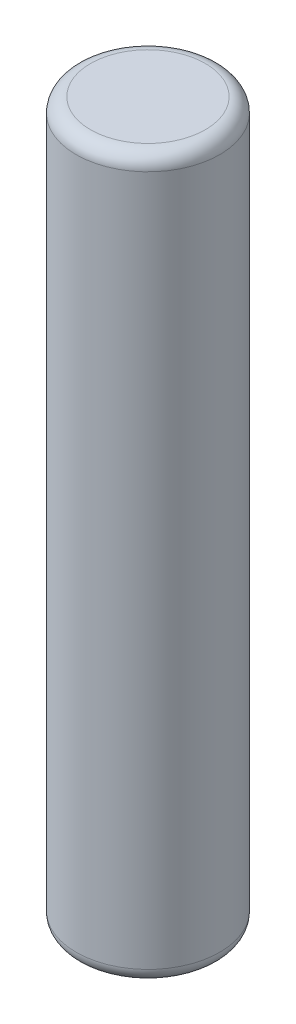
ISO-10303-21;
HEADER;
FILE_DESCRIPTION(('STEP AP214'),'2;1');
FILE_NAME('part.step','',(''),(''),'','','');
FILE_SCHEMA(('AUTOMOTIVE_DESIGN { 1 0 10303 214 1 1 1 1 }'));
ENDSEC;
DATA;
#1=APPLICATION_CONTEXT('core data for automotive mechanical design processes');
#2=APPLICATION_PROTOCOL_DEFINITION('international standard','automotive_design',2000,#1);
#3=PRODUCT_CONTEXT('',#1,'mechanical');
#4=PRODUCT('Part','Part','',(#3));
#5=PRODUCT_RELATED_PRODUCT_CATEGORY('part','',(#4));
#6=PRODUCT_DEFINITION_FORMATION('','',#4);
#7=PRODUCT_DEFINITION_CONTEXT('part definition',#1,'design');
#8=PRODUCT_DEFINITION('design','',#6,#7);
#9=PRODUCT_DEFINITION_SHAPE('','',#8);
#10=(LENGTH_UNIT() NAMED_UNIT(*) SI_UNIT(.MILLI.,.METRE.));
#11=(NAMED_UNIT(*) PLANE_ANGLE_UNIT() SI_UNIT($,.RADIAN.));
#12=(NAMED_UNIT(*) SI_UNIT($,.STERADIAN.) SOLID_ANGLE_UNIT());
#13=UNCERTAINTY_MEASURE_WITH_UNIT(LENGTH_MEASURE(1.E-05),#10,'distance_accuracy_value','');
#14=(GEOMETRIC_REPRESENTATION_CONTEXT(3) GLOBAL_UNCERTAINTY_ASSIGNED_CONTEXT((#13)) GLOBAL_UNIT_ASSIGNED_CONTEXT((#10,
#11,#12)) REPRESENTATION_CONTEXT('',''));
#15=CARTESIAN_POINT('',(0.,0.,0.));
#16=DIRECTION('',(0.,0.,1.));
#17=DIRECTION('',(1.,0.,0.));
#18=AXIS2_PLACEMENT_3D('',#15,#16,#17);
#19=CARTESIAN_POINT('',(0.,50.,0.));
#20=DIRECTION('',(0.,-1.,0.));
#21=DIRECTION('',(0.,0.,-1.));
#22=AXIS2_PLACEMENT_3D('',#19,#20,#21);
#23=CYLINDRICAL_SURFACE('',#22,4.99);
#24=CARTESIAN_POINT('',(0.,1.,0.));
#25=DIRECTION('',(0.,1.,0.));
#26=DIRECTION('',(0.,0.,1.));
#27=AXIS2_PLACEMENT_3D('',#24,#25,#26);
#28=CIRCLE('',#27,4.99);
#29=CARTESIAN_POINT('',(0.,1.,4.99));
#30=VERTEX_POINT('',#29);
#31=EDGE_CURVE('E42',#30,#30,#28,.T.);
#32=ORIENTED_EDGE('',*,*,#31,.T.);
#33=EDGE_LOOP('',(#32));
#34=FACE_BOUND('',#33,.T.);
#35=CARTESIAN_POINT('',(0.,49.,0.));
#36=DIRECTION('',(0.,1.,0.));
#37=DIRECTION('',(0.,0.,1.));
#38=AXIS2_PLACEMENT_3D('',#35,#36,#37);
#39=CIRCLE('',#38,4.99);
#40=CARTESIAN_POINT('',(0.,49.,4.99));
#41=VERTEX_POINT('',#40);
#42=EDGE_CURVE('E46',#41,#41,#39,.F.);
#43=ORIENTED_EDGE('',*,*,#42,.T.);
#44=EDGE_LOOP('',(#43));
#45=FACE_BOUND('',#44,.T.);
#46=ADVANCED_FACE('F31',(#34,#45),#23,.T.);
#47=CARTESIAN_POINT('',(0.,50.,0.));
#48=DIRECTION('',(0.,1.,0.));
#49=DIRECTION('',(0.,0.,1.));
#50=AXIS2_PLACEMENT_3D('',#47,#48,#49);
#51=PLANE('',#50);
#52=CARTESIAN_POINT('',(0.,50.,0.));
#53=DIRECTION('',(0.,1.,0.));
#54=DIRECTION('',(0.,0.,1.));
#55=AXIS2_PLACEMENT_3D('',#52,#53,#54);
#56=CIRCLE('',#55,3.99);
#57=CARTESIAN_POINT('',(0.,50.,3.99));
#58=VERTEX_POINT('',#57);
#59=EDGE_CURVE('E10',#58,#58,#56,.T.);
#60=ORIENTED_EDGE('',*,*,#59,.T.);
#61=EDGE_LOOP('',(#60));
#62=FACE_BOUND('',#61,.T.);
#63=ADVANCED_FACE('F62',(#62),#51,.T.);
#64=CARTESIAN_POINT('',(0.,0.,0.));
#65=DIRECTION('',(0.,1.,0.));
#66=DIRECTION('',(0.,0.,1.));
#67=AXIS2_PLACEMENT_3D('',#64,#65,#66);
#68=PLANE('',#67);
#69=CARTESIAN_POINT('',(0.,0.,0.));
#70=DIRECTION('',(0.,1.,0.));
#71=DIRECTION('',(0.,0.,1.));
#72=AXIS2_PLACEMENT_3D('',#69,#70,#71);
#73=CIRCLE('',#72,3.99);
#74=CARTESIAN_POINT('',(0.,0.,3.99));
#75=VERTEX_POINT('',#74);
#76=EDGE_CURVE('E38',#75,#75,#73,.F.);
#77=ORIENTED_EDGE('',*,*,#76,.T.);
#78=EDGE_LOOP('',(#77));
#79=FACE_BOUND('',#78,.T.);
#80=ADVANCED_FACE('F59',(#79),#68,.F.);
#81=CARTESIAN_POINT('',(0.,1.,0.));
#82=DIRECTION('',(0.,1.,0.));
#83=DIRECTION('',(0.,0.,1.));
#84=AXIS2_PLACEMENT_3D('',#81,#82,#83);
#85=TOROIDAL_SURFACE('',#84,3.99,1.);
#86=ORIENTED_EDGE('',*,*,#76,.F.);
#87=EDGE_LOOP('',(#86));
#88=FACE_BOUND('',#87,.T.);
#89=ORIENTED_EDGE('',*,*,#31,.F.);
#90=EDGE_LOOP('',(#89));
#91=FACE_BOUND('',#90,.T.);
#92=ADVANCED_FACE('F55',(#88,#91),#85,.T.);
#93=CARTESIAN_POINT('',(0.,49.,0.));
#94=DIRECTION('',(0.,1.,0.));
#95=DIRECTION('',(0.,0.,1.));
#96=AXIS2_PLACEMENT_3D('',#93,#94,#95);
#97=TOROIDAL_SURFACE('',#96,3.99,1.);
#98=ORIENTED_EDGE('',*,*,#42,.F.);
#99=EDGE_LOOP('',(#98));
#100=FACE_BOUND('',#99,.T.);
#101=ORIENTED_EDGE('',*,*,#59,.F.);
#102=EDGE_LOOP('',(#101));
#103=FACE_BOUND('',#102,.T.);
#104=ADVANCED_FACE('F33',(#100,#103),#97,.T.);
#105=CLOSED_SHELL('',(#46,#63,#80,#92,#104));
#106=MANIFOLD_SOLID_BREP('B2',#105);
#107=ADVANCED_BREP_SHAPE_REPRESENTATION('',(#18,#106),#14);
#108=SHAPE_DEFINITION_REPRESENTATION(#9,#107);
ENDSEC;
END-ISO-10303-21;
